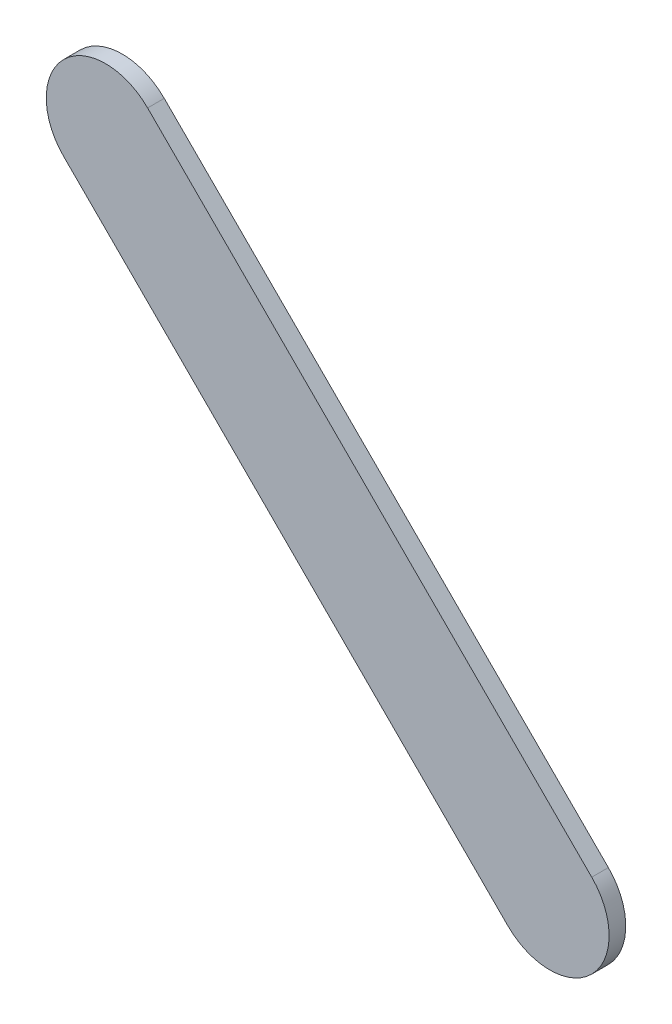
ISO-10303-21;
HEADER;
FILE_DESCRIPTION(('STEP AP214'),'2;1');
FILE_NAME('part.step','',(''),(''),'','','');
FILE_SCHEMA(('AUTOMOTIVE_DESIGN { 1 0 10303 214 1 1 1 1 }'));
ENDSEC;
DATA;
#1=APPLICATION_CONTEXT('core data for automotive mechanical design processes');
#2=APPLICATION_PROTOCOL_DEFINITION('international standard','automotive_design',2000,#1);
#3=PRODUCT_CONTEXT('',#1,'mechanical');
#4=PRODUCT('Part','Part','',(#3));
#5=PRODUCT_RELATED_PRODUCT_CATEGORY('part','',(#4));
#6=PRODUCT_DEFINITION_FORMATION('','',#4);
#7=PRODUCT_DEFINITION_CONTEXT('part definition',#1,'design');
#8=PRODUCT_DEFINITION('design','',#6,#7);
#9=PRODUCT_DEFINITION_SHAPE('','',#8);
#10=(LENGTH_UNIT() NAMED_UNIT(*) SI_UNIT(.MILLI.,.METRE.));
#11=(NAMED_UNIT(*) PLANE_ANGLE_UNIT() SI_UNIT($,.RADIAN.));
#12=(NAMED_UNIT(*) SI_UNIT($,.STERADIAN.) SOLID_ANGLE_UNIT());
#13=UNCERTAINTY_MEASURE_WITH_UNIT(LENGTH_MEASURE(1.E-05),#10,'distance_accuracy_value','');
#14=(GEOMETRIC_REPRESENTATION_CONTEXT(3) GLOBAL_UNCERTAINTY_ASSIGNED_CONTEXT((#13)) GLOBAL_UNIT_ASSIGNED_CONTEXT((#10,
#11,#12)) REPRESENTATION_CONTEXT('',''));
#15=CARTESIAN_POINT('',(0.,0.,0.));
#16=DIRECTION('',(0.,0.,1.));
#17=DIRECTION('',(1.,0.,0.));
#18=AXIS2_PLACEMENT_3D('',#15,#16,#17);
#19=CARTESIAN_POINT('',(96.2771887,85.04715274,0.));
#20=DIRECTION('',(0.707106781186548,0.707106781186548,0.));
#21=DIRECTION('',(0.707106781186548,-0.707106781186548,0.));
#22=AXIS2_PLACEMENT_3D('',#19,#20,#21);
#23=PLANE('',#22);
#24=DIRECTION('',(0.707106781186548,-0.707106781186548,0.));
#25=VECTOR('',#24,1.);
#26=CARTESIAN_POINT('',(96.2771887,85.04715274,0.03556));
#27=LINE('',#26,#25);
#28=CARTESIAN_POINT('',(96.2771887,85.04715274,0.03556));
#29=VERTEX_POINT('',#28);
#30=CARTESIAN_POINT('',(97.2271995,84.09714194,0.03556));
#31=VERTEX_POINT('',#30);
#32=EDGE_CURVE('E11',#29,#31,#27,.T.);
#33=ORIENTED_EDGE('',*,*,#32,.F.);
#34=DIRECTION('',(0.,0.,1.));
#35=VECTOR('',#34,1.);
#36=CARTESIAN_POINT('',(96.2771887,85.04715274,0.));
#37=LINE('',#36,#35);
#38=CARTESIAN_POINT('',(96.2771887,85.04715274,0.));
#39=VERTEX_POINT('',#38);
#40=EDGE_CURVE('E24',#39,#29,#37,.T.);
#41=ORIENTED_EDGE('',*,*,#40,.F.);
#42=DIRECTION('',(0.707106781186548,-0.707106781186548,0.));
#43=VECTOR('',#42,1.);
#44=CARTESIAN_POINT('',(96.2771887,85.04715274,0.));
#45=LINE('',#44,#43);
#46=CARTESIAN_POINT('',(97.2271995,84.09714194,0.));
#47=VERTEX_POINT('',#46);
#48=EDGE_CURVE('E75',#39,#47,#45,.T.);
#49=ORIENTED_EDGE('',*,*,#48,.T.);
#50=DIRECTION('',(0.,0.,1.));
#51=VECTOR('',#50,1.);
#52=CARTESIAN_POINT('',(97.2271995,84.09714194,0.));
#53=LINE('',#52,#51);
#54=EDGE_CURVE('E37',#47,#31,#53,.T.);
#55=ORIENTED_EDGE('',*,*,#54,.T.);
#56=EDGE_LOOP('',(#33,#41,#49,#55));
#57=FACE_BOUND('',#56,.T.);
#58=ADVANCED_FACE('F17',(#57),#23,.F.);
#59=CARTESIAN_POINT('',(97.3170012,84.18694364,0.));
#60=DIRECTION('',(0.,0.,-1.));
#61=DIRECTION('',(-0.707106781186492,-0.707106781186604,0.));
#62=AXIS2_PLACEMENT_3D('',#59,#60,#61);
#63=CYLINDRICAL_SURFACE('',#62,0.126998782064167);
#64=CARTESIAN_POINT('',(97.3170012,84.18694364,0.03556));
#65=DIRECTION('',(0.,0.,1.));
#66=DIRECTION('',(-0.707106781186492,-0.707106781186604,0.));
#67=AXIS2_PLACEMENT_3D('',#64,#65,#66);
#68=CIRCLE('',#67,0.126998782064167);
#69=CARTESIAN_POINT('',(97.4068029,84.27674534,0.03556));
#70=VERTEX_POINT('',#69);
#71=EDGE_CURVE('E83',#31,#70,#68,.T.);
#72=ORIENTED_EDGE('',*,*,#71,.F.);
#73=ORIENTED_EDGE('',*,*,#54,.F.);
#74=CARTESIAN_POINT('',(97.3170012,84.18694364,0.));
#75=DIRECTION('',(0.,0.,1.));
#76=DIRECTION('',(-0.707106781186492,-0.707106781186604,0.));
#77=AXIS2_PLACEMENT_3D('',#74,#75,#76);
#78=CIRCLE('',#77,0.126998782064167);
#79=CARTESIAN_POINT('',(97.4068029,84.27674534,0.));
#80=VERTEX_POINT('',#79);
#81=EDGE_CURVE('E81',#47,#80,#78,.T.);
#82=ORIENTED_EDGE('',*,*,#81,.T.);
#83=DIRECTION('',(0.,0.,1.));
#84=VECTOR('',#83,1.);
#85=CARTESIAN_POINT('',(97.4068029,84.27674534,0.));
#86=LINE('',#85,#84);
#87=EDGE_CURVE('E67',#80,#70,#86,.T.);
#88=ORIENTED_EDGE('',*,*,#87,.T.);
#89=EDGE_LOOP('',(#72,#73,#82,#88));
#90=FACE_BOUND('',#89,.T.);
#91=ADVANCED_FACE('F89',(#90),#63,.T.);
#92=CARTESIAN_POINT('',(97.4068029,84.27674534,0.));
#93=DIRECTION('',(-0.707106781186548,-0.707106781186548,0.));
#94=DIRECTION('',(-0.707106781186548,0.707106781186548,0.));
#95=AXIS2_PLACEMENT_3D('',#92,#93,#94);
#96=PLANE('',#95);
#97=DIRECTION('',(-0.707106781186548,0.707106781186548,0.));
#98=VECTOR('',#97,1.);
#99=CARTESIAN_POINT('',(97.4068029,84.27674534,0.03556));
#100=LINE('',#99,#98);
#101=CARTESIAN_POINT('',(96.4567921,85.22675614,0.03556));
#102=VERTEX_POINT('',#101);
#103=EDGE_CURVE('E71',#70,#102,#100,.T.);
#104=ORIENTED_EDGE('',*,*,#103,.F.);
#105=ORIENTED_EDGE('',*,*,#87,.F.);
#106=DIRECTION('',(-0.707106781186548,0.707106781186548,0.));
#107=VECTOR('',#106,1.);
#108=CARTESIAN_POINT('',(97.4068029,84.27674534,0.));
#109=LINE('',#108,#107);
#110=CARTESIAN_POINT('',(96.4567921,85.22675614,0.));
#111=VERTEX_POINT('',#110);
#112=EDGE_CURVE('E63',#80,#111,#109,.T.);
#113=ORIENTED_EDGE('',*,*,#112,.T.);
#114=DIRECTION('',(0.,0.,1.));
#115=VECTOR('',#114,1.);
#116=CARTESIAN_POINT('',(96.4567921,85.22675614,0.));
#117=LINE('',#116,#115);
#118=EDGE_CURVE('E53',#111,#102,#117,.T.);
#119=ORIENTED_EDGE('',*,*,#118,.T.);
#120=EDGE_LOOP('',(#104,#105,#113,#119));
#121=FACE_BOUND('',#120,.T.);
#122=ADVANCED_FACE('F66',(#121),#96,.F.);
#123=CARTESIAN_POINT('',(96.3669904,85.13695444,0.));
#124=DIRECTION('',(0.,0.,-1.));
#125=DIRECTION('',(0.707106781186604,0.707106781186492,0.));
#126=AXIS2_PLACEMENT_3D('',#123,#124,#125);
#127=CYLINDRICAL_SURFACE('',#126,0.12699878206416);
#128=CARTESIAN_POINT('',(96.3669904,85.13695444,0.03556));
#129=DIRECTION('',(0.,0.,1.));
#130=DIRECTION('',(0.707106781186604,0.707106781186492,0.));
#131=AXIS2_PLACEMENT_3D('',#128,#129,#130);
#132=CIRCLE('',#131,0.12699878206416);
#133=EDGE_CURVE('E59',#102,#29,#132,.T.);
#134=ORIENTED_EDGE('',*,*,#133,.F.);
#135=ORIENTED_EDGE('',*,*,#118,.F.);
#136=CARTESIAN_POINT('',(96.3669904,85.13695444,0.));
#137=DIRECTION('',(0.,0.,1.));
#138=DIRECTION('',(0.707106781186604,0.707106781186492,0.));
#139=AXIS2_PLACEMENT_3D('',#136,#137,#138);
#140=CIRCLE('',#139,0.12699878206416);
#141=EDGE_CURVE('E57',#111,#39,#140,.T.);
#142=ORIENTED_EDGE('',*,*,#141,.T.);
#143=ORIENTED_EDGE('',*,*,#40,.T.);
#144=EDGE_LOOP('',(#134,#135,#142,#143));
#145=FACE_BOUND('',#144,.T.);
#146=ADVANCED_FACE('F55',(#145),#127,.T.);
#147=CARTESIAN_POINT('',(96.2771887,85.04715274,0.));
#148=DIRECTION('',(0.,0.,-1.));
#149=DIRECTION('',(-1.,0.,0.));
#150=AXIS2_PLACEMENT_3D('',#147,#148,#149);
#151=PLANE('',#150);
#152=ORIENTED_EDGE('',*,*,#141,.F.);
#153=ORIENTED_EDGE('',*,*,#112,.F.);
#154=ORIENTED_EDGE('',*,*,#81,.F.);
#155=ORIENTED_EDGE('',*,*,#48,.F.);
#156=EDGE_LOOP('',(#152,#153,#154,#155));
#157=FACE_BOUND('',#156,.T.);
#158=ADVANCED_FACE('F74',(#157),#151,.T.);
#159=CARTESIAN_POINT('',(96.2771887,85.04715274,0.03556));
#160=DIRECTION('',(0.,0.,-1.));
#161=DIRECTION('',(-1.,0.,0.));
#162=AXIS2_PLACEMENT_3D('',#159,#160,#161);
#163=PLANE('',#162);
#164=ORIENTED_EDGE('',*,*,#32,.T.);
#165=ORIENTED_EDGE('',*,*,#71,.T.);
#166=ORIENTED_EDGE('',*,*,#103,.T.);
#167=ORIENTED_EDGE('',*,*,#133,.T.);
#168=EDGE_LOOP('',(#164,#165,#166,#167));
#169=FACE_BOUND('',#168,.T.);
#170=ADVANCED_FACE('F91',(#169),#163,.F.);
#171=CLOSED_SHELL('',(#58,#91,#122,#146,#158,#170));
#172=MANIFOLD_SOLID_BREP('B1',#171);
#173=ADVANCED_BREP_SHAPE_REPRESENTATION('',(#18,#172),#14);
#174=SHAPE_DEFINITION_REPRESENTATION(#9,#173);
ENDSEC;
END-ISO-10303-21;
